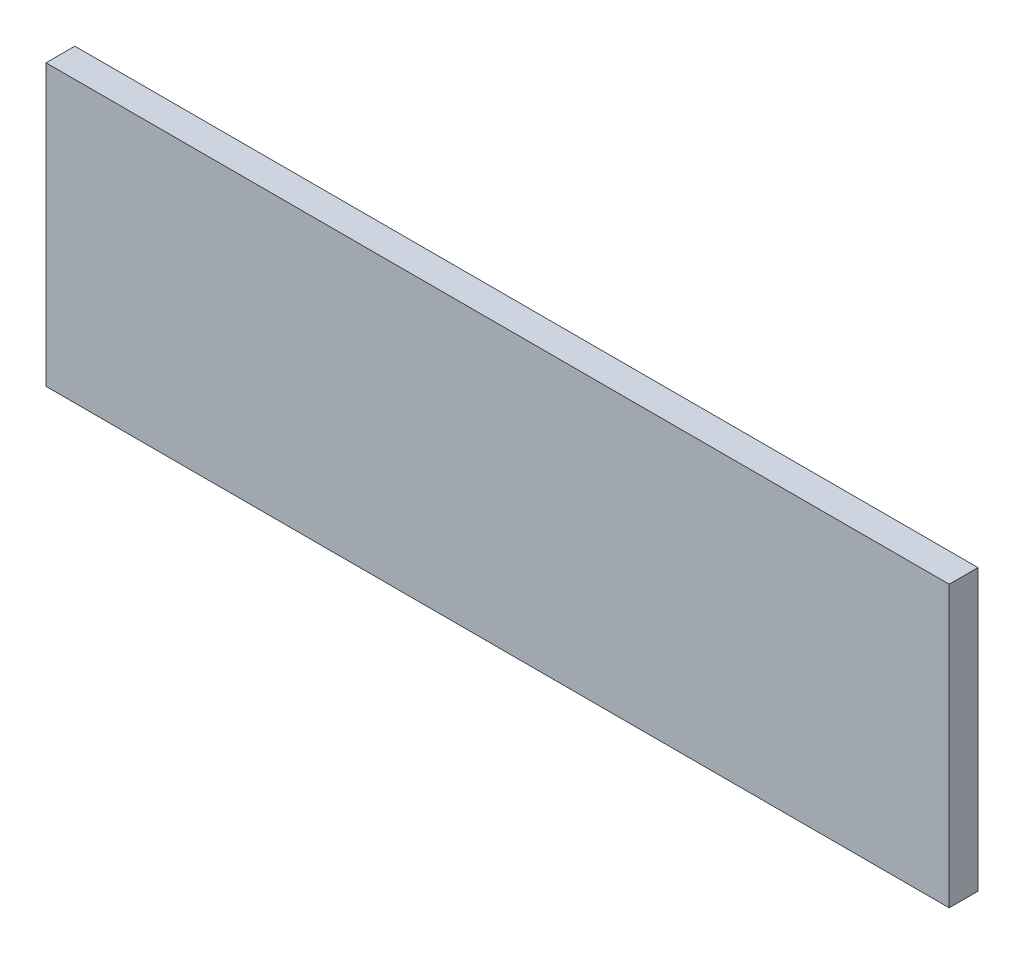
ISO-10303-21;
HEADER;
FILE_DESCRIPTION(('STEP AP214'),'2;1');
FILE_NAME('part.step','',(''),(''),'','','');
FILE_SCHEMA(('AUTOMOTIVE_DESIGN { 1 0 10303 214 1 1 1 1 }'));
ENDSEC;
DATA;
#1=APPLICATION_CONTEXT('core data for automotive mechanical design processes');
#2=APPLICATION_PROTOCOL_DEFINITION('international standard','automotive_design',2000,#1);
#3=PRODUCT_CONTEXT('',#1,'mechanical');
#4=PRODUCT('Part','Part','',(#3));
#5=PRODUCT_RELATED_PRODUCT_CATEGORY('part','',(#4));
#6=PRODUCT_DEFINITION_FORMATION('','',#4);
#7=PRODUCT_DEFINITION_CONTEXT('part definition',#1,'design');
#8=PRODUCT_DEFINITION('design','',#6,#7);
#9=PRODUCT_DEFINITION_SHAPE('','',#8);
#10=(LENGTH_UNIT() NAMED_UNIT(*) SI_UNIT(.MILLI.,.METRE.));
#11=(NAMED_UNIT(*) PLANE_ANGLE_UNIT() SI_UNIT($,.RADIAN.));
#12=(NAMED_UNIT(*) SI_UNIT($,.STERADIAN.) SOLID_ANGLE_UNIT());
#13=UNCERTAINTY_MEASURE_WITH_UNIT(LENGTH_MEASURE(1.E-05),#10,'distance_accuracy_value','');
#14=(GEOMETRIC_REPRESENTATION_CONTEXT(3) GLOBAL_UNCERTAINTY_ASSIGNED_CONTEXT((#13)) GLOBAL_UNIT_ASSIGNED_CONTEXT((#10,
#11,#12)) REPRESENTATION_CONTEXT('',''));
#15=CARTESIAN_POINT('',(0.,0.,0.));
#16=DIRECTION('',(0.,0.,1.));
#17=DIRECTION('',(1.,0.,0.));
#18=AXIS2_PLACEMENT_3D('',#15,#16,#17);
#19=CARTESIAN_POINT('',(-282.,-87.5,18.));
#20=DIRECTION('',(1.,0.,0.));
#21=DIRECTION('',(0.,0.,-1.));
#22=AXIS2_PLACEMENT_3D('',#19,#20,#21);
#23=PLANE('',#22);
#24=DIRECTION('',(0.,-1.,0.));
#25=VECTOR('',#24,1.);
#26=CARTESIAN_POINT('',(-282.,-87.5,0.));
#27=LINE('',#26,#25);
#28=CARTESIAN_POINT('',(-282.,87.5,0.));
#29=VERTEX_POINT('',#28);
#30=CARTESIAN_POINT('',(-282.,-87.5,0.));
#31=VERTEX_POINT('',#30);
#32=EDGE_CURVE('E96',#29,#31,#27,.T.);
#33=ORIENTED_EDGE('',*,*,#32,.T.);
#34=DIRECTION('',(0.,0.,-1.));
#35=VECTOR('',#34,1.);
#36=CARTESIAN_POINT('',(-282.,-87.5,18.));
#37=LINE('',#36,#35);
#38=CARTESIAN_POINT('',(-282.,-87.5,18.));
#39=VERTEX_POINT('',#38);
#40=EDGE_CURVE('E11',#39,#31,#37,.T.);
#41=ORIENTED_EDGE('',*,*,#40,.F.);
#42=DIRECTION('',(0.,-1.,0.));
#43=VECTOR('',#42,1.);
#44=CARTESIAN_POINT('',(-282.,-87.5,18.));
#45=LINE('',#44,#43);
#46=CARTESIAN_POINT('',(-282.,87.5,18.));
#47=VERTEX_POINT('',#46);
#48=EDGE_CURVE('E84',#47,#39,#45,.T.);
#49=ORIENTED_EDGE('',*,*,#48,.F.);
#50=DIRECTION('',(0.,0.,-1.));
#51=VECTOR('',#50,1.);
#52=CARTESIAN_POINT('',(-282.,87.5,18.));
#53=LINE('',#52,#51);
#54=EDGE_CURVE('E92',#47,#29,#53,.T.);
#55=ORIENTED_EDGE('',*,*,#54,.T.);
#56=EDGE_LOOP('',(#33,#41,#49,#55));
#57=FACE_BOUND('',#56,.T.);
#58=ADVANCED_FACE('F33',(#57),#23,.F.);
#59=CARTESIAN_POINT('',(282.,-87.4999999999999,18.));
#60=DIRECTION('',(0.,1.,0.));
#61=DIRECTION('',(-1.,0.,0.));
#62=AXIS2_PLACEMENT_3D('',#59,#60,#61);
#63=PLANE('',#62);
#64=DIRECTION('',(1.,0.,0.));
#65=VECTOR('',#64,1.);
#66=CARTESIAN_POINT('',(282.,-87.4999999999999,0.));
#67=LINE('',#66,#65);
#68=CARTESIAN_POINT('',(282.,-87.4999999999999,0.));
#69=VERTEX_POINT('',#68);
#70=EDGE_CURVE('E88',#31,#69,#67,.T.);
#71=ORIENTED_EDGE('',*,*,#70,.T.);
#72=DIRECTION('',(0.,0.,-1.));
#73=VECTOR('',#72,1.);
#74=CARTESIAN_POINT('',(282.,-87.4999999999999,18.));
#75=LINE('',#74,#73);
#76=CARTESIAN_POINT('',(282.,-87.4999999999999,18.));
#77=VERTEX_POINT('',#76);
#78=EDGE_CURVE('E41',#77,#69,#75,.T.);
#79=ORIENTED_EDGE('',*,*,#78,.F.);
#80=DIRECTION('',(1.,0.,0.));
#81=VECTOR('',#80,1.);
#82=CARTESIAN_POINT('',(282.,-87.4999999999999,18.));
#83=LINE('',#82,#81);
#84=EDGE_CURVE('E79',#39,#77,#83,.T.);
#85=ORIENTED_EDGE('',*,*,#84,.F.);
#86=ORIENTED_EDGE('',*,*,#40,.T.);
#87=EDGE_LOOP('',(#71,#79,#85,#86));
#88=FACE_BOUND('',#87,.T.);
#89=ADVANCED_FACE('F87',(#88),#63,.F.);
#90=CARTESIAN_POINT('',(282.,-87.4999999999999,18.));
#91=DIRECTION('',(-1.,0.,0.));
#92=DIRECTION('',(0.,0.,1.));
#93=AXIS2_PLACEMENT_3D('',#90,#91,#92);
#94=PLANE('',#93);
#95=DIRECTION('',(0.,1.,0.));
#96=VECTOR('',#95,1.);
#97=CARTESIAN_POINT('',(282.,-87.4999999999999,0.));
#98=LINE('',#97,#96);
#99=CARTESIAN_POINT('',(282.,87.5000000000001,0.));
#100=VERTEX_POINT('',#99);
#101=EDGE_CURVE('E66',#69,#100,#98,.T.);
#102=ORIENTED_EDGE('',*,*,#101,.T.);
#103=DIRECTION('',(0.,0.,-1.));
#104=VECTOR('',#103,1.);
#105=CARTESIAN_POINT('',(282.,87.5000000000001,18.));
#106=LINE('',#105,#104);
#107=CARTESIAN_POINT('',(282.,87.5000000000001,18.));
#108=VERTEX_POINT('',#107);
#109=EDGE_CURVE('E89',#108,#100,#106,.T.);
#110=ORIENTED_EDGE('',*,*,#109,.F.);
#111=DIRECTION('',(0.,1.,0.));
#112=VECTOR('',#111,1.);
#113=CARTESIAN_POINT('',(282.,-87.4999999999999,18.));
#114=LINE('',#113,#112);
#115=EDGE_CURVE('E82',#77,#108,#114,.T.);
#116=ORIENTED_EDGE('',*,*,#115,.F.);
#117=ORIENTED_EDGE('',*,*,#78,.T.);
#118=EDGE_LOOP('',(#102,#110,#116,#117));
#119=FACE_BOUND('',#118,.T.);
#120=ADVANCED_FACE('F90',(#119),#94,.F.);
#121=CARTESIAN_POINT('',(282.,87.5000000000001,18.));
#122=DIRECTION('',(0.,-1.,0.));
#123=DIRECTION('',(1.,0.,0.));
#124=AXIS2_PLACEMENT_3D('',#121,#122,#123);
#125=PLANE('',#124);
#126=DIRECTION('',(-1.,0.,0.));
#127=VECTOR('',#126,1.);
#128=CARTESIAN_POINT('',(282.,87.5000000000001,0.));
#129=LINE('',#128,#127);
#130=EDGE_CURVE('E72',#100,#29,#129,.T.);
#131=ORIENTED_EDGE('',*,*,#130,.T.);
#132=ORIENTED_EDGE('',*,*,#54,.F.);
#133=DIRECTION('',(-1.,0.,0.));
#134=VECTOR('',#133,1.);
#135=CARTESIAN_POINT('',(282.,87.5000000000001,18.));
#136=LINE('',#135,#134);
#137=EDGE_CURVE('E49',#108,#47,#136,.T.);
#138=ORIENTED_EDGE('',*,*,#137,.F.);
#139=ORIENTED_EDGE('',*,*,#109,.T.);
#140=EDGE_LOOP('',(#131,#132,#138,#139));
#141=FACE_BOUND('',#140,.T.);
#142=ADVANCED_FACE('F103',(#141),#125,.F.);
#143=CARTESIAN_POINT('',(0.,0.,18.));
#144=DIRECTION('',(0.,0.,1.));
#145=DIRECTION('',(1.,0.,0.));
#146=AXIS2_PLACEMENT_3D('',#143,#144,#145);
#147=PLANE('',#146);
#148=ORIENTED_EDGE('',*,*,#48,.T.);
#149=ORIENTED_EDGE('',*,*,#84,.T.);
#150=ORIENTED_EDGE('',*,*,#115,.T.);
#151=ORIENTED_EDGE('',*,*,#137,.T.);
#152=EDGE_LOOP('',(#148,#149,#150,#151));
#153=FACE_BOUND('',#152,.T.);
#154=ADVANCED_FACE('F80',(#153),#147,.T.);
#155=CARTESIAN_POINT('',(0.,0.,0.));
#156=DIRECTION('',(0.,0.,1.));
#157=DIRECTION('',(1.,0.,0.));
#158=AXIS2_PLACEMENT_3D('',#155,#156,#157);
#159=PLANE('',#158);
#160=ORIENTED_EDGE('',*,*,#32,.F.);
#161=ORIENTED_EDGE('',*,*,#130,.F.);
#162=ORIENTED_EDGE('',*,*,#101,.F.);
#163=ORIENTED_EDGE('',*,*,#70,.F.);
#164=EDGE_LOOP('',(#160,#161,#162,#163));
#165=FACE_BOUND('',#164,.T.);
#166=ADVANCED_FACE('F106',(#165),#159,.F.);
#167=CLOSED_SHELL('',(#58,#89,#120,#142,#154,#166));
#168=MANIFOLD_SOLID_BREP('B2',#167);
#169=ADVANCED_BREP_SHAPE_REPRESENTATION('',(#18,#168),#14);
#170=SHAPE_DEFINITION_REPRESENTATION(#9,#169);
ENDSEC;
END-ISO-10303-21;
